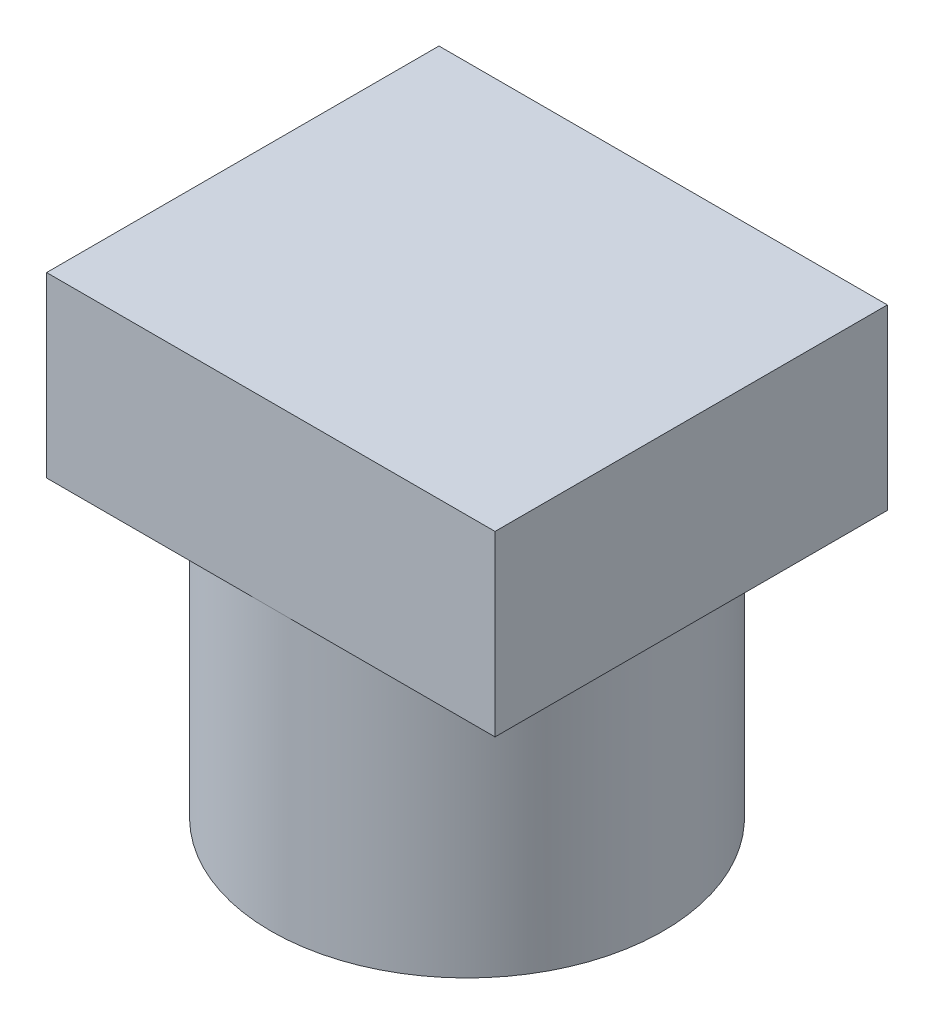
ISO-10303-21;
HEADER;
FILE_DESCRIPTION(('STEP AP214'),'2;1');
FILE_NAME('part.step','',(''),(''),'','','');
FILE_SCHEMA(('AUTOMOTIVE_DESIGN { 1 0 10303 214 1 1 1 1 }'));
ENDSEC;
DATA;
#1=APPLICATION_CONTEXT('core data for automotive mechanical design processes');
#2=APPLICATION_PROTOCOL_DEFINITION('international standard','automotive_design',2000,#1);
#3=PRODUCT_CONTEXT('',#1,'mechanical');
#4=PRODUCT('Part','Part','',(#3));
#5=PRODUCT_RELATED_PRODUCT_CATEGORY('part','',(#4));
#6=PRODUCT_DEFINITION_FORMATION('','',#4);
#7=PRODUCT_DEFINITION_CONTEXT('part definition',#1,'design');
#8=PRODUCT_DEFINITION('design','',#6,#7);
#9=PRODUCT_DEFINITION_SHAPE('','',#8);
#10=(LENGTH_UNIT() NAMED_UNIT(*) SI_UNIT(.MILLI.,.METRE.));
#11=(NAMED_UNIT(*) PLANE_ANGLE_UNIT() SI_UNIT($,.RADIAN.));
#12=(NAMED_UNIT(*) SI_UNIT($,.STERADIAN.) SOLID_ANGLE_UNIT());
#13=UNCERTAINTY_MEASURE_WITH_UNIT(LENGTH_MEASURE(1.E-05),#10,'distance_accuracy_value','');
#14=(GEOMETRIC_REPRESENTATION_CONTEXT(3) GLOBAL_UNCERTAINTY_ASSIGNED_CONTEXT((#13)) GLOBAL_UNIT_ASSIGNED_CONTEXT((#10,
#11,#12)) REPRESENTATION_CONTEXT('',''));
#15=CARTESIAN_POINT('',(0.,0.,0.));
#16=DIRECTION('',(0.,0.,1.));
#17=DIRECTION('',(1.,0.,0.));
#18=AXIS2_PLACEMENT_3D('',#15,#16,#17);
#19=CARTESIAN_POINT('',(0.,0.,0.));
#20=DIRECTION('',(0.,1.,0.));
#21=DIRECTION('',(0.,0.,1.));
#22=AXIS2_PLACEMENT_3D('',#19,#20,#21);
#23=PLANE('',#22);
#24=CARTESIAN_POINT('',(0.,0.,0.));
#25=DIRECTION('',(0.,1.,0.));
#26=DIRECTION('',(0.,0.,1.));
#27=AXIS2_PLACEMENT_3D('',#24,#25,#26);
#28=CIRCLE('',#27,3.5);
#29=CARTESIAN_POINT('',(0.,0.,3.5));
#30=VERTEX_POINT('',#29);
#31=EDGE_CURVE('E41',#30,#30,#28,.T.);
#32=ORIENTED_EDGE('',*,*,#31,.F.);
#33=EDGE_LOOP('',(#32));
#34=FACE_BOUND('',#33,.T.);
#35=CARTESIAN_POINT('',(0.,0.,0.));
#36=DIRECTION('',(0.,1.,0.));
#37=DIRECTION('',(0.,0.,1.));
#38=AXIS2_PLACEMENT_3D('',#35,#36,#37);
#39=CIRCLE('',#38,2.);
#40=CARTESIAN_POINT('',(0.,0.,2.));
#41=VERTEX_POINT('',#40);
#42=EDGE_CURVE('E108',#41,#41,#39,.T.);
#43=ORIENTED_EDGE('',*,*,#42,.T.);
#44=EDGE_LOOP('',(#43));
#45=FACE_BOUND('',#44,.T.);
#46=ADVANCED_FACE('F37',(#34,#45),#23,.F.);
#47=CARTESIAN_POINT('',(0.,5.,0.));
#48=DIRECTION('',(0.,-1.,0.));
#49=DIRECTION('',(0.,0.,-1.));
#50=AXIS2_PLACEMENT_3D('',#47,#48,#49);
#51=CYLINDRICAL_SURFACE('',#50,3.5);
#52=CARTESIAN_POINT('',(0.,5.,0.));
#53=DIRECTION('',(0.,1.,0.));
#54=DIRECTION('',(0.,0.,1.));
#55=AXIS2_PLACEMENT_3D('',#52,#53,#54);
#56=CIRCLE('',#55,3.5);
#57=CARTESIAN_POINT('',(0.,5.,3.5));
#58=VERTEX_POINT('',#57);
#59=CARTESIAN_POINT('',(0.,5.,-3.5));
#60=VERTEX_POINT('',#59);
#61=EDGE_CURVE('E11',#58,#60,#56,.T.);
#62=ORIENTED_EDGE('',*,*,#61,.F.);
#63=EDGE_CURVE('E46',#60,#58,#56,.T.);
#64=ORIENTED_EDGE('',*,*,#63,.F.);
#65=EDGE_LOOP('',(#62,#64));
#66=FACE_BOUND('',#65,.T.);
#67=ORIENTED_EDGE('',*,*,#31,.T.);
#68=EDGE_LOOP('',(#67));
#69=FACE_BOUND('',#68,.T.);
#70=ADVANCED_FACE('F39',(#66,#69),#51,.T.);
#71=CARTESIAN_POINT('',(0.,5.,0.));
#72=DIRECTION('',(0.,-1.,0.));
#73=DIRECTION('',(0.,0.,-1.));
#74=AXIS2_PLACEMENT_3D('',#71,#72,#73);
#75=CYLINDRICAL_SURFACE('',#74,2.);
#76=CARTESIAN_POINT('',(0.,5.,0.));
#77=DIRECTION('',(0.,1.,0.));
#78=DIRECTION('',(0.,0.,1.));
#79=AXIS2_PLACEMENT_3D('',#76,#77,#78);
#80=CIRCLE('',#79,2.);
#81=CARTESIAN_POINT('',(0.,5.,2.));
#82=VERTEX_POINT('',#81);
#83=EDGE_CURVE('E105',#82,#82,#80,.T.);
#84=ORIENTED_EDGE('',*,*,#83,.T.);
#85=EDGE_LOOP('',(#84));
#86=FACE_BOUND('',#85,.T.);
#87=ORIENTED_EDGE('',*,*,#42,.F.);
#88=EDGE_LOOP('',(#87));
#89=FACE_BOUND('',#88,.T.);
#90=ADVANCED_FACE('F160',(#86,#89),#75,.F.);
#91=CARTESIAN_POINT('',(0.,5.,0.));
#92=DIRECTION('',(0.,1.,0.));
#93=DIRECTION('',(0.,0.,1.));
#94=AXIS2_PLACEMENT_3D('',#91,#92,#93);
#95=PLANE('',#94);
#96=ORIENTED_EDGE('',*,*,#83,.F.);
#97=EDGE_LOOP('',(#96));
#98=FACE_BOUND('',#97,.T.);
#99=ADVANCED_FACE('F164',(#98),#95,.F.);
#100=DIRECTION('',(1.,0.,0.));
#101=VECTOR('',#100,1.);
#102=CARTESIAN_POINT('',(-4.,5.,3.5));
#103=LINE('',#102,#101);
#104=CARTESIAN_POINT('',(4.,5.,3.5));
#105=VERTEX_POINT('',#104);
#106=EDGE_CURVE('E129',#58,#105,#103,.T.);
#107=ORIENTED_EDGE('',*,*,#106,.F.);
#108=ORIENTED_EDGE('',*,*,#61,.T.);
#109=DIRECTION('',(-1.,0.,0.));
#110=VECTOR('',#109,1.);
#111=CARTESIAN_POINT('',(-4.,5.,-3.5));
#112=LINE('',#111,#110);
#113=CARTESIAN_POINT('',(4.,5.,-3.5));
#114=VERTEX_POINT('',#113);
#115=EDGE_CURVE('E100',#114,#60,#112,.T.);
#116=ORIENTED_EDGE('',*,*,#115,.F.);
#117=DIRECTION('',(0.,0.,-1.));
#118=VECTOR('',#117,1.);
#119=CARTESIAN_POINT('',(4.,5.,-3.5));
#120=LINE('',#119,#118);
#121=EDGE_CURVE('E132',#105,#114,#120,.T.);
#122=ORIENTED_EDGE('',*,*,#121,.F.);
#123=EDGE_LOOP('',(#107,#108,#116,#122));
#124=FACE_BOUND('',#123,.T.);
#125=ADVANCED_FACE('F130',(#124),#95,.F.);
#126=CARTESIAN_POINT('',(-4.,5.,-3.5));
#127=VERTEX_POINT('',#126);
#128=EDGE_CURVE('E125',#60,#127,#112,.T.);
#129=ORIENTED_EDGE('',*,*,#128,.F.);
#130=ORIENTED_EDGE('',*,*,#63,.T.);
#131=CARTESIAN_POINT('',(-4.,5.,3.5));
#132=VERTEX_POINT('',#131);
#133=EDGE_CURVE('E124',#132,#58,#103,.T.);
#134=ORIENTED_EDGE('',*,*,#133,.F.);
#135=DIRECTION('',(0.,0.,1.));
#136=VECTOR('',#135,1.);
#137=CARTESIAN_POINT('',(-4.,5.,-3.5));
#138=LINE('',#137,#136);
#139=EDGE_CURVE('E104',#127,#132,#138,.T.);
#140=ORIENTED_EDGE('',*,*,#139,.F.);
#141=EDGE_LOOP('',(#129,#130,#134,#140));
#142=FACE_BOUND('',#141,.T.);
#143=ADVANCED_FACE('F123',(#142),#95,.F.);
#144=CARTESIAN_POINT('',(-4.,8.175,-3.5));
#145=DIRECTION('',(1.,0.,0.));
#146=DIRECTION('',(0.,0.,-1.));
#147=AXIS2_PLACEMENT_3D('',#144,#145,#146);
#148=PLANE('',#147);
#149=ORIENTED_EDGE('',*,*,#139,.T.);
#150=DIRECTION('',(0.,-1.,0.));
#151=VECTOR('',#150,1.);
#152=CARTESIAN_POINT('',(-4.,8.175,3.5));
#153=LINE('',#152,#151);
#154=CARTESIAN_POINT('',(-4.,8.175,3.5));
#155=VERTEX_POINT('',#154);
#156=EDGE_CURVE('E84',#155,#132,#153,.T.);
#157=ORIENTED_EDGE('',*,*,#156,.F.);
#158=DIRECTION('',(0.,0.,1.));
#159=VECTOR('',#158,1.);
#160=CARTESIAN_POINT('',(-4.,8.175,-3.5));
#161=LINE('',#160,#159);
#162=CARTESIAN_POINT('',(-4.,8.175,-3.5));
#163=VERTEX_POINT('',#162);
#164=EDGE_CURVE('E91',#163,#155,#161,.T.);
#165=ORIENTED_EDGE('',*,*,#164,.F.);
#166=DIRECTION('',(0.,-1.,0.));
#167=VECTOR('',#166,1.);
#168=CARTESIAN_POINT('',(-4.,8.175,-3.5));
#169=LINE('',#168,#167);
#170=EDGE_CURVE('E139',#163,#127,#169,.T.);
#171=ORIENTED_EDGE('',*,*,#170,.T.);
#172=EDGE_LOOP('',(#149,#157,#165,#171));
#173=FACE_BOUND('',#172,.T.);
#174=ADVANCED_FACE('F102',(#173),#148,.F.);
#175=CARTESIAN_POINT('',(-4.,8.175,3.5));
#176=DIRECTION('',(0.,0.,-1.));
#177=DIRECTION('',(-1.,0.,0.));
#178=AXIS2_PLACEMENT_3D('',#175,#176,#177);
#179=PLANE('',#178);
#180=ORIENTED_EDGE('',*,*,#133,.T.);
#181=ORIENTED_EDGE('',*,*,#106,.T.);
#182=DIRECTION('',(0.,-1.,0.));
#183=VECTOR('',#182,1.);
#184=CARTESIAN_POINT('',(4.,8.175,3.5));
#185=LINE('',#184,#183);
#186=CARTESIAN_POINT('',(4.,8.175,3.5));
#187=VERTEX_POINT('',#186);
#188=EDGE_CURVE('E87',#187,#105,#185,.T.);
#189=ORIENTED_EDGE('',*,*,#188,.F.);
#190=DIRECTION('',(1.,0.,0.));
#191=VECTOR('',#190,1.);
#192=CARTESIAN_POINT('',(-4.,8.175,3.5));
#193=LINE('',#192,#191);
#194=EDGE_CURVE('E79',#155,#187,#193,.T.);
#195=ORIENTED_EDGE('',*,*,#194,.F.);
#196=ORIENTED_EDGE('',*,*,#156,.T.);
#197=EDGE_LOOP('',(#180,#181,#189,#195,#196));
#198=FACE_BOUND('',#197,.T.);
#199=ADVANCED_FACE('F82',(#198),#179,.F.);
#200=CARTESIAN_POINT('',(4.,8.175,-3.5));
#201=DIRECTION('',(-1.,0.,0.));
#202=DIRECTION('',(0.,0.,1.));
#203=AXIS2_PLACEMENT_3D('',#200,#201,#202);
#204=PLANE('',#203);
#205=ORIENTED_EDGE('',*,*,#121,.T.);
#206=DIRECTION('',(0.,-1.,0.));
#207=VECTOR('',#206,1.);
#208=CARTESIAN_POINT('',(4.,8.175,-3.5));
#209=LINE('',#208,#207);
#210=CARTESIAN_POINT('',(4.,8.175,-3.5));
#211=VERTEX_POINT('',#210);
#212=EDGE_CURVE('E110',#211,#114,#209,.T.);
#213=ORIENTED_EDGE('',*,*,#212,.F.);
#214=DIRECTION('',(0.,0.,-1.));
#215=VECTOR('',#214,1.);
#216=CARTESIAN_POINT('',(4.,8.175,-3.5));
#217=LINE('',#216,#215);
#218=EDGE_CURVE('E90',#187,#211,#217,.T.);
#219=ORIENTED_EDGE('',*,*,#218,.F.);
#220=ORIENTED_EDGE('',*,*,#188,.T.);
#221=EDGE_LOOP('',(#205,#213,#219,#220));
#222=FACE_BOUND('',#221,.T.);
#223=ADVANCED_FACE('F145',(#222),#204,.F.);
#224=CARTESIAN_POINT('',(-4.,8.175,-3.5));
#225=DIRECTION('',(0.,0.,1.));
#226=DIRECTION('',(1.,0.,0.));
#227=AXIS2_PLACEMENT_3D('',#224,#225,#226);
#228=PLANE('',#227);
#229=ORIENTED_EDGE('',*,*,#115,.T.);
#230=ORIENTED_EDGE('',*,*,#128,.T.);
#231=ORIENTED_EDGE('',*,*,#170,.F.);
#232=DIRECTION('',(-1.,0.,0.));
#233=VECTOR('',#232,1.);
#234=CARTESIAN_POINT('',(-4.,8.175,-3.5));
#235=LINE('',#234,#233);
#236=EDGE_CURVE('E96',#211,#163,#235,.T.);
#237=ORIENTED_EDGE('',*,*,#236,.F.);
#238=ORIENTED_EDGE('',*,*,#212,.T.);
#239=EDGE_LOOP('',(#229,#230,#231,#237,#238));
#240=FACE_BOUND('',#239,.T.);
#241=ADVANCED_FACE('F143',(#240),#228,.F.);
#242=CARTESIAN_POINT('',(0.,8.175,0.));
#243=DIRECTION('',(0.,1.,0.));
#244=DIRECTION('',(0.,0.,1.));
#245=AXIS2_PLACEMENT_3D('',#242,#243,#244);
#246=PLANE('',#245);
#247=ORIENTED_EDGE('',*,*,#164,.T.);
#248=ORIENTED_EDGE('',*,*,#194,.T.);
#249=ORIENTED_EDGE('',*,*,#218,.T.);
#250=ORIENTED_EDGE('',*,*,#236,.T.);
#251=EDGE_LOOP('',(#247,#248,#249,#250));
#252=FACE_BOUND('',#251,.T.);
#253=ADVANCED_FACE('F94',(#252),#246,.T.);
#254=CLOSED_SHELL('',(#46,#70,#90,#99,#125,#143,#174,#199,#223,#241,#253));
#255=MANIFOLD_SOLID_BREP('B2',#254);
#256=ADVANCED_BREP_SHAPE_REPRESENTATION('',(#18,#255),#14);
#257=SHAPE_DEFINITION_REPRESENTATION(#9,#256);
ENDSEC;
END-ISO-10303-21;
